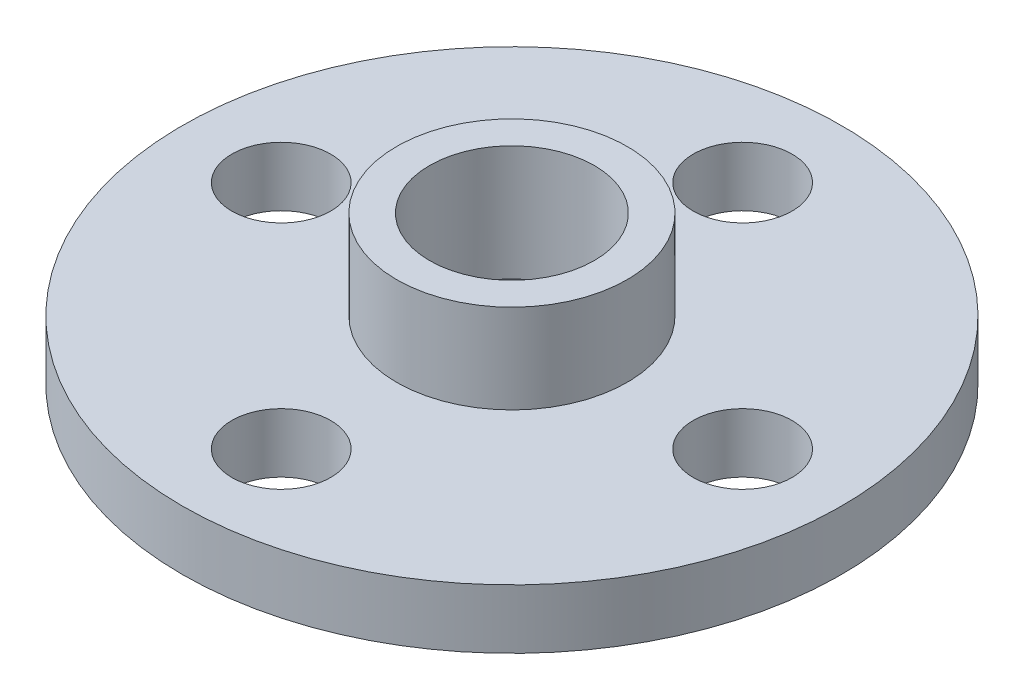
ISO-10303-21;
HEADER;
FILE_DESCRIPTION(('STEP AP214'),'2;1');
FILE_NAME('part.step','',(''),(''),'','','');
FILE_SCHEMA(('AUTOMOTIVE_DESIGN { 1 0 10303 214 1 1 1 1 }'));
ENDSEC;
DATA;
#1=APPLICATION_CONTEXT('core data for automotive mechanical design processes');
#2=APPLICATION_PROTOCOL_DEFINITION('international standard','automotive_design',2000,#1);
#3=PRODUCT_CONTEXT('',#1,'mechanical');
#4=PRODUCT('Part','Part','',(#3));
#5=PRODUCT_RELATED_PRODUCT_CATEGORY('part','',(#4));
#6=PRODUCT_DEFINITION_FORMATION('','',#4);
#7=PRODUCT_DEFINITION_CONTEXT('part definition',#1,'design');
#8=PRODUCT_DEFINITION('design','',#6,#7);
#9=PRODUCT_DEFINITION_SHAPE('','',#8);
#10=(LENGTH_UNIT() NAMED_UNIT(*) SI_UNIT(.MILLI.,.METRE.));
#11=(NAMED_UNIT(*) PLANE_ANGLE_UNIT() SI_UNIT($,.RADIAN.));
#12=(NAMED_UNIT(*) SI_UNIT($,.STERADIAN.) SOLID_ANGLE_UNIT());
#13=UNCERTAINTY_MEASURE_WITH_UNIT(LENGTH_MEASURE(1.E-05),#10,'distance_accuracy_value','');
#14=(GEOMETRIC_REPRESENTATION_CONTEXT(3) GLOBAL_UNCERTAINTY_ASSIGNED_CONTEXT((#13)) GLOBAL_UNIT_ASSIGNED_CONTEXT((#10,
#11,#12)) REPRESENTATION_CONTEXT('',''));
#15=CARTESIAN_POINT('',(0.,0.,0.));
#16=DIRECTION('',(0.,0.,1.));
#17=DIRECTION('',(1.,0.,0.));
#18=AXIS2_PLACEMENT_3D('',#15,#16,#17);
#19=CARTESIAN_POINT('',(0.,1.8,0.));
#20=DIRECTION('',(0.,-1.,0.));
#21=DIRECTION('',(0.,0.,-1.));
#22=AXIS2_PLACEMENT_3D('',#19,#20,#21);
#23=CYLINDRICAL_SURFACE('',#22,2.5);
#24=CARTESIAN_POINT('',(0.,4.5,0.));
#25=DIRECTION('',(0.,1.,0.));
#26=DIRECTION('',(0.,0.,1.));
#27=AXIS2_PLACEMENT_3D('',#24,#25,#26);
#28=CIRCLE('',#27,2.5);
#29=CARTESIAN_POINT('',(0.,4.5,2.5));
#30=VERTEX_POINT('',#29);
#31=EDGE_CURVE('E72',#30,#30,#28,.T.);
#32=ORIENTED_EDGE('',*,*,#31,.T.);
#33=EDGE_LOOP('',(#32));
#34=FACE_BOUND('',#33,.T.);
#35=CARTESIAN_POINT('',(0.,1.,0.));
#36=DIRECTION('',(0.,-1.,0.));
#37=DIRECTION('',(0.,0.,-1.));
#38=AXIS2_PLACEMENT_3D('',#35,#36,#37);
#39=CIRCLE('',#38,2.5);
#40=CARTESIAN_POINT('',(0.,1.,-2.5));
#41=VERTEX_POINT('',#40);
#42=EDGE_CURVE('E77',#41,#41,#39,.T.);
#43=ORIENTED_EDGE('',*,*,#42,.T.);
#44=EDGE_LOOP('',(#43));
#45=FACE_BOUND('',#44,.T.);
#46=ADVANCED_FACE('F32',(#34,#45),#23,.F.);
#47=CARTESIAN_POINT('',(0.,1.8,0.));
#48=DIRECTION('',(0.,1.,0.));
#49=DIRECTION('',(0.,0.,1.));
#50=AXIS2_PLACEMENT_3D('',#47,#48,#49);
#51=PLANE('',#50);
#52=CARTESIAN_POINT('',(-6.9999999999998,1.8,1.98523339633126E-13));
#53=DIRECTION('',(0.,1.,0.));
#54=DIRECTION('',(0.,0.,1.));
#55=AXIS2_PLACEMENT_3D('',#52,#53,#54);
#56=CIRCLE('',#55,1.50000000000032);
#57=CARTESIAN_POINT('',(-6.9999999999998,1.8,1.50000000000052));
#58=VERTEX_POINT('',#57);
#59=EDGE_CURVE('E60',#58,#58,#56,.T.);
#60=ORIENTED_EDGE('',*,*,#59,.F.);
#61=EDGE_LOOP('',(#60));
#62=FACE_BOUND('',#61,.T.);
#63=CARTESIAN_POINT('',(7.0000000000002,1.8,-1.97666086873723E-13));
#64=DIRECTION('',(0.,1.,0.));
#65=DIRECTION('',(0.,0.,1.));
#66=AXIS2_PLACEMENT_3D('',#63,#64,#65);
#67=CIRCLE('',#66,1.50000000000015);
#68=CARTESIAN_POINT('',(7.0000000000002,1.8,1.49999999999996));
#69=VERTEX_POINT('',#68);
#70=EDGE_CURVE('E48',#69,#69,#67,.T.);
#71=ORIENTED_EDGE('',*,*,#70,.F.);
#72=EDGE_LOOP('',(#71));
#73=FACE_BOUND('',#72,.T.);
#74=CARTESIAN_POINT('',(0.,1.8,0.));
#75=DIRECTION('',(0.,1.,0.));
#76=DIRECTION('',(0.,0.,1.));
#77=AXIS2_PLACEMENT_3D('',#74,#75,#76);
#78=CIRCLE('',#77,10.);
#79=CARTESIAN_POINT('',(0.,1.8,10.));
#80=VERTEX_POINT('',#79);
#81=EDGE_CURVE('E10',#80,#80,#78,.T.);
#82=ORIENTED_EDGE('',*,*,#81,.T.);
#83=EDGE_LOOP('',(#82));
#84=FACE_BOUND('',#83,.T.);
#85=CARTESIAN_POINT('',(0.,1.8,-7.));
#86=DIRECTION('',(0.,1.,0.));
#87=DIRECTION('',(0.,0.,1.));
#88=AXIS2_PLACEMENT_3D('',#85,#86,#87);
#89=CIRCLE('',#88,1.5);
#90=CARTESIAN_POINT('',(0.,1.8,-5.5));
#91=VERTEX_POINT('',#90);
#92=EDGE_CURVE('E43',#91,#91,#89,.T.);
#93=ORIENTED_EDGE('',*,*,#92,.F.);
#94=EDGE_LOOP('',(#93));
#95=FACE_BOUND('',#94,.T.);
#96=CARTESIAN_POINT('',(3.95332173747447E-13,1.8,7.));
#97=DIRECTION('',(0.,1.,0.));
#98=DIRECTION('',(0.,0.,1.));
#99=AXIS2_PLACEMENT_3D('',#96,#97,#98);
#100=CIRCLE('',#99,1.50000000000042);
#101=CARTESIAN_POINT('',(3.95332173747447E-13,1.8,8.50000000000043));
#102=VERTEX_POINT('',#101);
#103=EDGE_CURVE('E54',#102,#102,#100,.T.);
#104=ORIENTED_EDGE('',*,*,#103,.F.);
#105=EDGE_LOOP('',(#104));
#106=FACE_BOUND('',#105,.T.);
#107=CARTESIAN_POINT('',(0.,1.8,0.));
#108=DIRECTION('',(0.,1.,0.));
#109=DIRECTION('',(0.,0.,1.));
#110=AXIS2_PLACEMENT_3D('',#107,#108,#109);
#111=CIRCLE('',#110,3.5);
#112=CARTESIAN_POINT('',(0.,1.8,3.5));
#113=VERTEX_POINT('',#112);
#114=EDGE_CURVE('E69',#113,#113,#111,.T.);
#115=ORIENTED_EDGE('',*,*,#114,.F.);
#116=EDGE_LOOP('',(#115));
#117=FACE_BOUND('',#116,.T.);
#118=ADVANCED_FACE('F94',(#62,#73,#84,#95,#106,#117),#51,.T.);
#119=CARTESIAN_POINT('',(0.,0.,0.));
#120=DIRECTION('',(0.,1.,0.));
#121=DIRECTION('',(0.,0.,1.));
#122=AXIS2_PLACEMENT_3D('',#119,#120,#121);
#123=PLANE('',#122);
#124=CARTESIAN_POINT('',(0.,0.,0.));
#125=DIRECTION('',(0.,1.,0.));
#126=DIRECTION('',(0.,0.,1.));
#127=AXIS2_PLACEMENT_3D('',#124,#125,#126);
#128=CIRCLE('',#127,10.);
#129=CARTESIAN_POINT('',(0.,0.,10.));
#130=VERTEX_POINT('',#129);
#131=EDGE_CURVE('E36',#130,#130,#128,.T.);
#132=ORIENTED_EDGE('',*,*,#131,.F.);
#133=EDGE_LOOP('',(#132));
#134=FACE_BOUND('',#133,.T.);
#135=CARTESIAN_POINT('',(0.,0.,-7.));
#136=DIRECTION('',(0.,1.,0.));
#137=DIRECTION('',(0.,0.,1.));
#138=AXIS2_PLACEMENT_3D('',#135,#136,#137);
#139=CIRCLE('',#138,1.5);
#140=CARTESIAN_POINT('',(0.,0.,-5.5));
#141=VERTEX_POINT('',#140);
#142=EDGE_CURVE('E45',#141,#141,#139,.T.);
#143=ORIENTED_EDGE('',*,*,#142,.T.);
#144=EDGE_LOOP('',(#143));
#145=FACE_BOUND('',#144,.T.);
#146=CARTESIAN_POINT('',(7.0000000000002,0.,-1.97666086873723E-13));
#147=DIRECTION('',(0.,1.,0.));
#148=DIRECTION('',(0.,0.,1.));
#149=AXIS2_PLACEMENT_3D('',#146,#147,#148);
#150=CIRCLE('',#149,1.50000000000015);
#151=CARTESIAN_POINT('',(7.0000000000002,0.,1.49999999999996));
#152=VERTEX_POINT('',#151);
#153=EDGE_CURVE('E51',#152,#152,#150,.T.);
#154=ORIENTED_EDGE('',*,*,#153,.T.);
#155=EDGE_LOOP('',(#154));
#156=FACE_BOUND('',#155,.T.);
#157=CARTESIAN_POINT('',(3.95332173747447E-13,0.,7.));
#158=DIRECTION('',(0.,1.,0.));
#159=DIRECTION('',(0.,0.,1.));
#160=AXIS2_PLACEMENT_3D('',#157,#158,#159);
#161=CIRCLE('',#160,1.50000000000042);
#162=CARTESIAN_POINT('',(3.95332173747447E-13,0.,8.50000000000043));
#163=VERTEX_POINT('',#162);
#164=EDGE_CURVE('E57',#163,#163,#161,.T.);
#165=ORIENTED_EDGE('',*,*,#164,.T.);
#166=EDGE_LOOP('',(#165));
#167=FACE_BOUND('',#166,.T.);
#168=CARTESIAN_POINT('',(-6.9999999999998,0.,1.98523339633126E-13));
#169=DIRECTION('',(0.,1.,0.));
#170=DIRECTION('',(0.,0.,1.));
#171=AXIS2_PLACEMENT_3D('',#168,#169,#170);
#172=CIRCLE('',#171,1.50000000000032);
#173=CARTESIAN_POINT('',(-6.9999999999998,0.,1.50000000000052));
#174=VERTEX_POINT('',#173);
#175=EDGE_CURVE('E63',#174,#174,#172,.T.);
#176=ORIENTED_EDGE('',*,*,#175,.T.);
#177=EDGE_LOOP('',(#176));
#178=FACE_BOUND('',#177,.T.);
#179=ADVANCED_FACE('F100',(#134,#145,#156,#167,#178),#123,.F.);
#180=CARTESIAN_POINT('',(0.,1.8,0.));
#181=DIRECTION('',(0.,-1.,0.));
#182=DIRECTION('',(0.,0.,-1.));
#183=AXIS2_PLACEMENT_3D('',#180,#181,#182);
#184=CYLINDRICAL_SURFACE('',#183,10.);
#185=ORIENTED_EDGE('',*,*,#81,.F.);
#186=EDGE_LOOP('',(#185));
#187=FACE_BOUND('',#186,.T.);
#188=ORIENTED_EDGE('',*,*,#131,.T.);
#189=EDGE_LOOP('',(#188));
#190=FACE_BOUND('',#189,.T.);
#191=ADVANCED_FACE('F34',(#187,#190),#184,.T.);
#192=CARTESIAN_POINT('',(0.,1.8,-7.));
#193=DIRECTION('',(0.,-1.,0.));
#194=DIRECTION('',(0.,0.,-1.));
#195=AXIS2_PLACEMENT_3D('',#192,#193,#194);
#196=CYLINDRICAL_SURFACE('',#195,1.5);
#197=ORIENTED_EDGE('',*,*,#92,.T.);
#198=EDGE_LOOP('',(#197));
#199=FACE_BOUND('',#198,.T.);
#200=ORIENTED_EDGE('',*,*,#142,.F.);
#201=EDGE_LOOP('',(#200));
#202=FACE_BOUND('',#201,.T.);
#203=ADVANCED_FACE('F104',(#199,#202),#196,.F.);
#204=CARTESIAN_POINT('',(7.0000000000002,1.8,-1.97666086873723E-13));
#205=DIRECTION('',(0.,-1.,0.));
#206=DIRECTION('',(0.,0.,-1.));
#207=AXIS2_PLACEMENT_3D('',#204,#205,#206);
#208=CYLINDRICAL_SURFACE('',#207,1.50000000000015);
#209=ORIENTED_EDGE('',*,*,#70,.T.);
#210=EDGE_LOOP('',(#209));
#211=FACE_BOUND('',#210,.T.);
#212=ORIENTED_EDGE('',*,*,#153,.F.);
#213=EDGE_LOOP('',(#212));
#214=FACE_BOUND('',#213,.T.);
#215=ADVANCED_FACE('F132',(#211,#214),#208,.F.);
#216=CARTESIAN_POINT('',(3.95332173747447E-13,1.8,7.));
#217=DIRECTION('',(0.,-1.,0.));
#218=DIRECTION('',(0.,0.,-1.));
#219=AXIS2_PLACEMENT_3D('',#216,#217,#218);
#220=CYLINDRICAL_SURFACE('',#219,1.50000000000042);
#221=ORIENTED_EDGE('',*,*,#103,.T.);
#222=EDGE_LOOP('',(#221));
#223=FACE_BOUND('',#222,.T.);
#224=ORIENTED_EDGE('',*,*,#164,.F.);
#225=EDGE_LOOP('',(#224));
#226=FACE_BOUND('',#225,.T.);
#227=ADVANCED_FACE('F124',(#223,#226),#220,.F.);
#228=CARTESIAN_POINT('',(-6.9999999999998,1.8,1.98523339633126E-13));
#229=DIRECTION('',(0.,-1.,0.));
#230=DIRECTION('',(0.,0.,-1.));
#231=AXIS2_PLACEMENT_3D('',#228,#229,#230);
#232=CYLINDRICAL_SURFACE('',#231,1.50000000000032);
#233=ORIENTED_EDGE('',*,*,#59,.T.);
#234=EDGE_LOOP('',(#233));
#235=FACE_BOUND('',#234,.T.);
#236=ORIENTED_EDGE('',*,*,#175,.F.);
#237=EDGE_LOOP('',(#236));
#238=FACE_BOUND('',#237,.T.);
#239=ADVANCED_FACE('F122',(#235,#238),#232,.F.);
#240=CARTESIAN_POINT('',(0.,4.5,0.));
#241=DIRECTION('',(0.,1.,0.));
#242=DIRECTION('',(0.,0.,1.));
#243=AXIS2_PLACEMENT_3D('',#240,#241,#242);
#244=PLANE('',#243);
#245=CARTESIAN_POINT('',(0.,4.5,0.));
#246=DIRECTION('',(0.,1.,0.));
#247=DIRECTION('',(0.,0.,1.));
#248=AXIS2_PLACEMENT_3D('',#245,#246,#247);
#249=CIRCLE('',#248,3.5);
#250=CARTESIAN_POINT('',(0.,4.5,3.5));
#251=VERTEX_POINT('',#250);
#252=EDGE_CURVE('E66',#251,#251,#249,.T.);
#253=ORIENTED_EDGE('',*,*,#252,.T.);
#254=EDGE_LOOP('',(#253));
#255=FACE_BOUND('',#254,.T.);
#256=ORIENTED_EDGE('',*,*,#31,.F.);
#257=EDGE_LOOP('',(#256));
#258=FACE_BOUND('',#257,.T.);
#259=ADVANCED_FACE('F89',(#255,#258),#244,.T.);
#260=CARTESIAN_POINT('',(0.,4.5,0.));
#261=DIRECTION('',(0.,-1.,0.));
#262=DIRECTION('',(0.,0.,-1.));
#263=AXIS2_PLACEMENT_3D('',#260,#261,#262);
#264=CYLINDRICAL_SURFACE('',#263,3.5);
#265=ORIENTED_EDGE('',*,*,#252,.F.);
#266=EDGE_LOOP('',(#265));
#267=FACE_BOUND('',#266,.T.);
#268=ORIENTED_EDGE('',*,*,#114,.T.);
#269=EDGE_LOOP('',(#268));
#270=FACE_BOUND('',#269,.T.);
#271=ADVANCED_FACE('F84',(#267,#270),#264,.T.);
#272=CARTESIAN_POINT('',(0.,1.,0.));
#273=DIRECTION('',(0.,-1.,0.));
#274=DIRECTION('',(0.,0.,-1.));
#275=AXIS2_PLACEMENT_3D('',#272,#273,#274);
#276=PLANE('',#275);
#277=ORIENTED_EDGE('',*,*,#42,.F.);
#278=EDGE_LOOP('',(#277));
#279=FACE_BOUND('',#278,.T.);
#280=ADVANCED_FACE('F82',(#279),#276,.F.);
#281=CLOSED_SHELL('',(#46,#118,#179,#191,#203,#215,#227,#239,#259,#271,#280));
#282=MANIFOLD_SOLID_BREP('B2',#281);
#283=ADVANCED_BREP_SHAPE_REPRESENTATION('',(#18,#282),#14);
#284=SHAPE_DEFINITION_REPRESENTATION(#9,#283);
ENDSEC;
END-ISO-10303-21;
